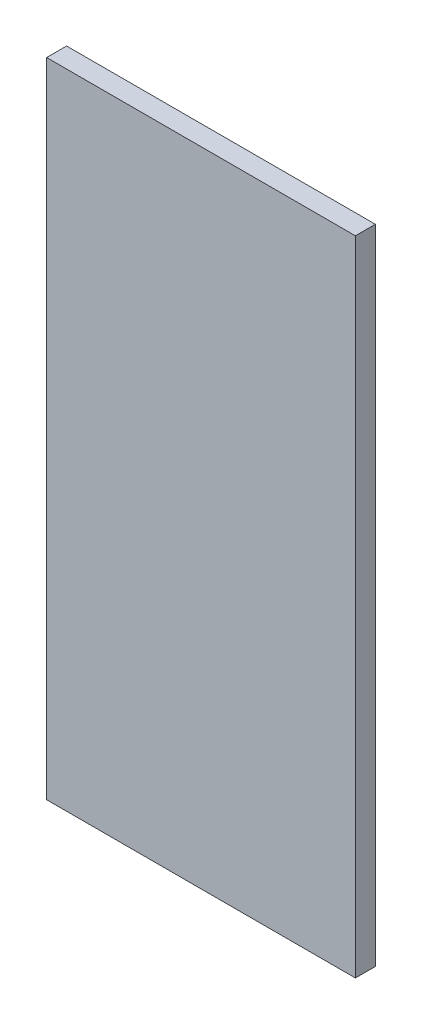
ISO-10303-21;
HEADER;
FILE_DESCRIPTION(('STEP AP214'),'2;1');
FILE_NAME('part.step','',(''),(''),'','','');
FILE_SCHEMA(('AUTOMOTIVE_DESIGN { 1 0 10303 214 1 1 1 1 }'));
ENDSEC;
DATA;
#1=APPLICATION_CONTEXT('core data for automotive mechanical design processes');
#2=APPLICATION_PROTOCOL_DEFINITION('international standard','automotive_design',2000,#1);
#3=PRODUCT_CONTEXT('',#1,'mechanical');
#4=PRODUCT('Part','Part','',(#3));
#5=PRODUCT_RELATED_PRODUCT_CATEGORY('part','',(#4));
#6=PRODUCT_DEFINITION_FORMATION('','',#4);
#7=PRODUCT_DEFINITION_CONTEXT('part definition',#1,'design');
#8=PRODUCT_DEFINITION('design','',#6,#7);
#9=PRODUCT_DEFINITION_SHAPE('','',#8);
#10=(LENGTH_UNIT() NAMED_UNIT(*) SI_UNIT(.MILLI.,.METRE.));
#11=(NAMED_UNIT(*) PLANE_ANGLE_UNIT() SI_UNIT($,.RADIAN.));
#12=(NAMED_UNIT(*) SI_UNIT($,.STERADIAN.) SOLID_ANGLE_UNIT());
#13=UNCERTAINTY_MEASURE_WITH_UNIT(LENGTH_MEASURE(1.E-05),#10,'distance_accuracy_value','');
#14=(GEOMETRIC_REPRESENTATION_CONTEXT(3) GLOBAL_UNCERTAINTY_ASSIGNED_CONTEXT((#13)) GLOBAL_UNIT_ASSIGNED_CONTEXT((#10,
#11,#12)) REPRESENTATION_CONTEXT('',''));
#15=CARTESIAN_POINT('',(0.,0.,0.));
#16=DIRECTION('',(0.,0.,1.));
#17=DIRECTION('',(1.,0.,0.));
#18=AXIS2_PLACEMENT_3D('',#15,#16,#17);
#19=CARTESIAN_POINT('',(88.6419982910156,102.857002258301,0.));
#20=DIRECTION('',(1.,0.,0.));
#21=DIRECTION('',(0.,-1.,0.));
#22=AXIS2_PLACEMENT_3D('',#19,#20,#21);
#23=PLANE('',#22);
#24=DIRECTION('',(0.,-1.,0.));
#25=VECTOR('',#24,1.);
#26=CARTESIAN_POINT('',(88.6419982910156,102.857002258301,0.03556));
#27=LINE('',#26,#25);
#28=CARTESIAN_POINT('',(88.6419982910156,102.857002258301,0.03556));
#29=VERTEX_POINT('',#28);
#30=CARTESIAN_POINT('',(88.6419982910156,101.71199798584,0.03556));
#31=VERTEX_POINT('',#30);
#32=EDGE_CURVE('E11',#29,#31,#27,.T.);
#33=ORIENTED_EDGE('',*,*,#32,.F.);
#34=DIRECTION('',(0.,0.,1.));
#35=VECTOR('',#34,1.);
#36=CARTESIAN_POINT('',(88.6419982910156,102.857002258301,0.));
#37=LINE('',#36,#35);
#38=CARTESIAN_POINT('',(88.6419982910156,102.857002258301,0.));
#39=VERTEX_POINT('',#38);
#40=EDGE_CURVE('E24',#39,#29,#37,.T.);
#41=ORIENTED_EDGE('',*,*,#40,.F.);
#42=DIRECTION('',(0.,-1.,0.));
#43=VECTOR('',#42,1.);
#44=CARTESIAN_POINT('',(88.6419982910156,102.857002258301,0.));
#45=LINE('',#44,#43);
#46=CARTESIAN_POINT('',(88.6419982910156,101.71199798584,0.));
#47=VERTEX_POINT('',#46);
#48=EDGE_CURVE('E75',#39,#47,#45,.T.);
#49=ORIENTED_EDGE('',*,*,#48,.T.);
#50=DIRECTION('',(0.,0.,1.));
#51=VECTOR('',#50,1.);
#52=CARTESIAN_POINT('',(88.6419982910156,101.71199798584,0.));
#53=LINE('',#52,#51);
#54=EDGE_CURVE('E37',#47,#31,#53,.T.);
#55=ORIENTED_EDGE('',*,*,#54,.T.);
#56=EDGE_LOOP('',(#33,#41,#49,#55));
#57=FACE_BOUND('',#56,.T.);
#58=ADVANCED_FACE('F17',(#57),#23,.F.);
#59=CARTESIAN_POINT('',(88.6419982910156,101.71199798584,0.));
#60=DIRECTION('',(0.,1.,0.));
#61=DIRECTION('',(1.,0.,0.));
#62=AXIS2_PLACEMENT_3D('',#59,#60,#61);
#63=PLANE('',#62);
#64=DIRECTION('',(1.,0.,0.));
#65=VECTOR('',#64,1.);
#66=CARTESIAN_POINT('',(88.6419982910156,101.71199798584,0.03556));
#67=LINE('',#66,#65);
#68=CARTESIAN_POINT('',(89.1920013427734,101.71199798584,0.03556));
#69=VERTEX_POINT('',#68);
#70=EDGE_CURVE('E83',#31,#69,#67,.T.);
#71=ORIENTED_EDGE('',*,*,#70,.F.);
#72=ORIENTED_EDGE('',*,*,#54,.F.);
#73=DIRECTION('',(1.,0.,0.));
#74=VECTOR('',#73,1.);
#75=CARTESIAN_POINT('',(88.6419982910156,101.71199798584,0.));
#76=LINE('',#75,#74);
#77=CARTESIAN_POINT('',(89.1920013427734,101.71199798584,0.));
#78=VERTEX_POINT('',#77);
#79=EDGE_CURVE('E81',#47,#78,#76,.T.);
#80=ORIENTED_EDGE('',*,*,#79,.T.);
#81=DIRECTION('',(0.,0.,1.));
#82=VECTOR('',#81,1.);
#83=CARTESIAN_POINT('',(89.1920013427734,101.71199798584,0.));
#84=LINE('',#83,#82);
#85=EDGE_CURVE('E67',#78,#69,#84,.T.);
#86=ORIENTED_EDGE('',*,*,#85,.T.);
#87=EDGE_LOOP('',(#71,#72,#80,#86));
#88=FACE_BOUND('',#87,.T.);
#89=ADVANCED_FACE('F89',(#88),#63,.F.);
#90=CARTESIAN_POINT('',(89.1920013427734,101.71199798584,0.));
#91=DIRECTION('',(-1.,0.,0.));
#92=DIRECTION('',(0.,1.,0.));
#93=AXIS2_PLACEMENT_3D('',#90,#91,#92);
#94=PLANE('',#93);
#95=DIRECTION('',(0.,1.,0.));
#96=VECTOR('',#95,1.);
#97=CARTESIAN_POINT('',(89.1920013427734,101.71199798584,0.03556));
#98=LINE('',#97,#96);
#99=CARTESIAN_POINT('',(89.1920013427734,102.857002258301,0.03556));
#100=VERTEX_POINT('',#99);
#101=EDGE_CURVE('E71',#69,#100,#98,.T.);
#102=ORIENTED_EDGE('',*,*,#101,.F.);
#103=ORIENTED_EDGE('',*,*,#85,.F.);
#104=DIRECTION('',(0.,1.,0.));
#105=VECTOR('',#104,1.);
#106=CARTESIAN_POINT('',(89.1920013427734,101.71199798584,0.));
#107=LINE('',#106,#105);
#108=CARTESIAN_POINT('',(89.1920013427734,102.857002258301,0.));
#109=VERTEX_POINT('',#108);
#110=EDGE_CURVE('E63',#78,#109,#107,.T.);
#111=ORIENTED_EDGE('',*,*,#110,.T.);
#112=DIRECTION('',(0.,0.,1.));
#113=VECTOR('',#112,1.);
#114=CARTESIAN_POINT('',(89.1920013427734,102.857002258301,0.));
#115=LINE('',#114,#113);
#116=EDGE_CURVE('E53',#109,#100,#115,.T.);
#117=ORIENTED_EDGE('',*,*,#116,.T.);
#118=EDGE_LOOP('',(#102,#103,#111,#117));
#119=FACE_BOUND('',#118,.T.);
#120=ADVANCED_FACE('F66',(#119),#94,.F.);
#121=CARTESIAN_POINT('',(89.1920013427734,102.857002258301,0.));
#122=DIRECTION('',(0.,-1.,0.));
#123=DIRECTION('',(-1.,0.,0.));
#124=AXIS2_PLACEMENT_3D('',#121,#122,#123);
#125=PLANE('',#124);
#126=DIRECTION('',(-1.,0.,0.));
#127=VECTOR('',#126,1.);
#128=CARTESIAN_POINT('',(89.1920013427734,102.857002258301,0.03556));
#129=LINE('',#128,#127);
#130=EDGE_CURVE('E59',#100,#29,#129,.T.);
#131=ORIENTED_EDGE('',*,*,#130,.F.);
#132=ORIENTED_EDGE('',*,*,#116,.F.);
#133=DIRECTION('',(-1.,0.,0.));
#134=VECTOR('',#133,1.);
#135=CARTESIAN_POINT('',(89.1920013427734,102.857002258301,0.));
#136=LINE('',#135,#134);
#137=EDGE_CURVE('E57',#109,#39,#136,.T.);
#138=ORIENTED_EDGE('',*,*,#137,.T.);
#139=ORIENTED_EDGE('',*,*,#40,.T.);
#140=EDGE_LOOP('',(#131,#132,#138,#139));
#141=FACE_BOUND('',#140,.T.);
#142=ADVANCED_FACE('F55',(#141),#125,.F.);
#143=CARTESIAN_POINT('',(88.6419982910156,102.857002258301,0.));
#144=DIRECTION('',(0.,0.,-1.));
#145=DIRECTION('',(-1.,0.,0.));
#146=AXIS2_PLACEMENT_3D('',#143,#144,#145);
#147=PLANE('',#146);
#148=ORIENTED_EDGE('',*,*,#137,.F.);
#149=ORIENTED_EDGE('',*,*,#110,.F.);
#150=ORIENTED_EDGE('',*,*,#79,.F.);
#151=ORIENTED_EDGE('',*,*,#48,.F.);
#152=EDGE_LOOP('',(#148,#149,#150,#151));
#153=FACE_BOUND('',#152,.T.);
#154=ADVANCED_FACE('F74',(#153),#147,.T.);
#155=CARTESIAN_POINT('',(88.6419982910156,102.857002258301,0.03556));
#156=DIRECTION('',(0.,0.,-1.));
#157=DIRECTION('',(-1.,0.,0.));
#158=AXIS2_PLACEMENT_3D('',#155,#156,#157);
#159=PLANE('',#158);
#160=ORIENTED_EDGE('',*,*,#32,.T.);
#161=ORIENTED_EDGE('',*,*,#70,.T.);
#162=ORIENTED_EDGE('',*,*,#101,.T.);
#163=ORIENTED_EDGE('',*,*,#130,.T.);
#164=EDGE_LOOP('',(#160,#161,#162,#163));
#165=FACE_BOUND('',#164,.T.);
#166=ADVANCED_FACE('F91',(#165),#159,.F.);
#167=CLOSED_SHELL('',(#58,#89,#120,#142,#154,#166));
#168=MANIFOLD_SOLID_BREP('B1',#167);
#169=ADVANCED_BREP_SHAPE_REPRESENTATION('',(#18,#168),#14);
#170=SHAPE_DEFINITION_REPRESENTATION(#9,#169);
ENDSEC;
END-ISO-10303-21;
